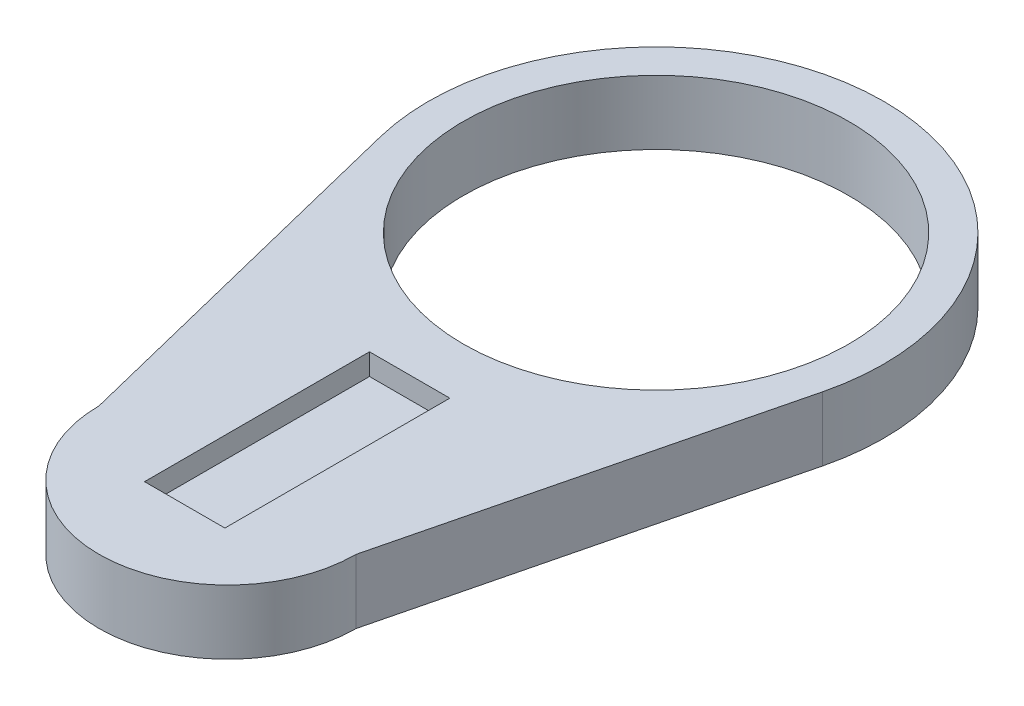
ISO-10303-21;
HEADER;
FILE_DESCRIPTION(('STEP AP214'),'2;1');
FILE_NAME('part.step','',(''),(''),'','','');
FILE_SCHEMA(('AUTOMOTIVE_DESIGN { 1 0 10303 214 1 1 1 1 }'));
ENDSEC;
DATA;
#1=APPLICATION_CONTEXT('core data for automotive mechanical design processes');
#2=APPLICATION_PROTOCOL_DEFINITION('international standard','automotive_design',2000,#1);
#3=PRODUCT_CONTEXT('',#1,'mechanical');
#4=PRODUCT('Part','Part','',(#3));
#5=PRODUCT_RELATED_PRODUCT_CATEGORY('part','',(#4));
#6=PRODUCT_DEFINITION_FORMATION('','',#4);
#7=PRODUCT_DEFINITION_CONTEXT('part definition',#1,'design');
#8=PRODUCT_DEFINITION('design','',#6,#7);
#9=PRODUCT_DEFINITION_SHAPE('','',#8);
#10=(LENGTH_UNIT() NAMED_UNIT(*) SI_UNIT(.MILLI.,.METRE.));
#11=(NAMED_UNIT(*) PLANE_ANGLE_UNIT() SI_UNIT($,.RADIAN.));
#12=(NAMED_UNIT(*) SI_UNIT($,.STERADIAN.) SOLID_ANGLE_UNIT());
#13=UNCERTAINTY_MEASURE_WITH_UNIT(LENGTH_MEASURE(1.E-05),#10,'distance_accuracy_value','');
#14=(GEOMETRIC_REPRESENTATION_CONTEXT(3) GLOBAL_UNCERTAINTY_ASSIGNED_CONTEXT((#13)) GLOBAL_UNIT_ASSIGNED_CONTEXT((#10,
#11,#12)) REPRESENTATION_CONTEXT('',''));
#15=CARTESIAN_POINT('',(0.,0.,0.));
#16=DIRECTION('',(0.,0.,1.));
#17=DIRECTION('',(1.,0.,0.));
#18=AXIS2_PLACEMENT_3D('',#15,#16,#17);
#19=CARTESIAN_POINT('',(0.,6.,-40.));
#20=DIRECTION('',(0.,1.,0.));
#21=DIRECTION('',(0.,0.,1.));
#22=AXIS2_PLACEMENT_3D('',#19,#20,#21);
#23=PLANE('',#22);
#24=DIRECTION('',(0.,0.,1.));
#25=VECTOR('',#24,1.);
#26=CARTESIAN_POINT('',(-3.75,6.,-17.));
#27=LINE('',#26,#25);
#28=CARTESIAN_POINT('',(-3.75,6.,-17.));
#29=VERTEX_POINT('',#28);
#30=CARTESIAN_POINT('',(-3.75,6.,4.));
#31=VERTEX_POINT('',#30);
#32=EDGE_CURVE('E57',#29,#31,#27,.T.);
#33=ORIENTED_EDGE('',*,*,#32,.F.);
#34=DIRECTION('',(-1.,0.,0.));
#35=VECTOR('',#34,1.);
#36=CARTESIAN_POINT('',(-3.75,6.,-17.));
#37=LINE('',#36,#35);
#38=CARTESIAN_POINT('',(3.75,6.,-17.));
#39=VERTEX_POINT('',#38);
#40=EDGE_CURVE('E139',#39,#29,#37,.T.);
#41=ORIENTED_EDGE('',*,*,#40,.F.);
#42=DIRECTION('',(0.,0.,-1.));
#43=VECTOR('',#42,1.);
#44=CARTESIAN_POINT('',(3.75,6.,-17.));
#45=LINE('',#44,#43);
#46=CARTESIAN_POINT('',(3.75,6.,4.));
#47=VERTEX_POINT('',#46);
#48=EDGE_CURVE('E143',#47,#39,#45,.T.);
#49=ORIENTED_EDGE('',*,*,#48,.F.);
#50=DIRECTION('',(1.,0.,0.));
#51=VECTOR('',#50,1.);
#52=CARTESIAN_POINT('',(-3.75,6.,4.));
#53=LINE('',#52,#51);
#54=EDGE_CURVE('E152',#31,#47,#53,.T.);
#55=ORIENTED_EDGE('',*,*,#54,.F.);
#56=EDGE_LOOP('',(#33,#41,#49,#55));
#57=FACE_BOUND('',#56,.T.);
#58=CARTESIAN_POINT('',(0.,6.,-40.));
#59=DIRECTION('',(0.,1.,0.));
#60=DIRECTION('',(0.,0.,1.));
#61=AXIS2_PLACEMENT_3D('',#58,#59,#60);
#62=CIRCLE('',#61,21.25);
#63=CARTESIAN_POINT('',(20.628820966928,6.,-34.8995837900784));
#64=VERTEX_POINT('',#63);
#65=CARTESIAN_POINT('',(-20.628820966928,6.,-34.8995837900784));
#66=VERTEX_POINT('',#65);
#67=EDGE_CURVE('E175',#64,#66,#62,.T.);
#68=ORIENTED_EDGE('',*,*,#67,.T.);
#69=DIRECTION('',(0.240019586349251,0.,0.970768045502495));
#70=VECTOR('',#69,1.);
#71=CARTESIAN_POINT('',(-20.628820966928,6.,-34.8995837900784));
#72=LINE('',#71,#70);
#73=CARTESIAN_POINT('',(-12.,6.,0.));
#74=VERTEX_POINT('',#73);
#75=EDGE_CURVE('E94',#66,#74,#72,.T.);
#76=ORIENTED_EDGE('',*,*,#75,.T.);
#77=CARTESIAN_POINT('',(0.,6.,0.));
#78=DIRECTION('',(0.,1.,0.));
#79=DIRECTION('',(0.,0.,1.));
#80=AXIS2_PLACEMENT_3D('',#77,#78,#79);
#81=CIRCLE('',#80,12.);
#82=CARTESIAN_POINT('',(12.,6.,0.));
#83=VERTEX_POINT('',#82);
#84=EDGE_CURVE('E180',#74,#83,#81,.T.);
#85=ORIENTED_EDGE('',*,*,#84,.T.);
#86=DIRECTION('',(0.240019586349251,0.,-0.970768045502495));
#87=VECTOR('',#86,1.);
#88=CARTESIAN_POINT('',(20.628820966928,6.,-34.8995837900784));
#89=LINE('',#88,#87);
#90=EDGE_CURVE('E66',#83,#64,#89,.T.);
#91=ORIENTED_EDGE('',*,*,#90,.T.);
#92=EDGE_LOOP('',(#68,#76,#85,#91));
#93=FACE_BOUND('',#92,.T.);
#94=CARTESIAN_POINT('',(0.,6.,-40.));
#95=DIRECTION('',(0.,1.,0.));
#96=DIRECTION('',(0.,0.,1.));
#97=AXIS2_PLACEMENT_3D('',#94,#95,#96);
#98=CIRCLE('',#97,18.);
#99=CARTESIAN_POINT('',(0.,6.,-22.));
#100=VERTEX_POINT('',#99);
#101=EDGE_CURVE('E167',#100,#100,#98,.T.);
#102=ORIENTED_EDGE('',*,*,#101,.F.);
#103=EDGE_LOOP('',(#102));
#104=FACE_BOUND('',#103,.T.);
#105=ADVANCED_FACE('F41',(#57,#93,#104),#23,.T.);
#106=CARTESIAN_POINT('',(0.,0.,-40.));
#107=DIRECTION('',(0.,1.,0.));
#108=DIRECTION('',(0.,0.,1.));
#109=AXIS2_PLACEMENT_3D('',#106,#107,#108);
#110=PLANE('',#109);
#111=CARTESIAN_POINT('',(0.,0.,-40.));
#112=DIRECTION('',(0.,1.,0.));
#113=DIRECTION('',(0.,0.,1.));
#114=AXIS2_PLACEMENT_3D('',#111,#112,#113);
#115=CIRCLE('',#114,21.25);
#116=CARTESIAN_POINT('',(20.628820966928,0.,-34.8995837900784));
#117=VERTEX_POINT('',#116);
#118=CARTESIAN_POINT('',(-20.628820966928,0.,-34.8995837900784));
#119=VERTEX_POINT('',#118);
#120=EDGE_CURVE('E171',#117,#119,#115,.T.);
#121=ORIENTED_EDGE('',*,*,#120,.F.);
#122=DIRECTION('',(0.240019586349251,0.,-0.970768045502495));
#123=VECTOR('',#122,1.);
#124=CARTESIAN_POINT('',(20.628820966928,0.,-34.8995837900784));
#125=LINE('',#124,#123);
#126=CARTESIAN_POINT('',(12.,0.,0.));
#127=VERTEX_POINT('',#126);
#128=EDGE_CURVE('E87',#127,#117,#125,.T.);
#129=ORIENTED_EDGE('',*,*,#128,.F.);
#130=CARTESIAN_POINT('',(0.,0.,0.));
#131=DIRECTION('',(0.,1.,0.));
#132=DIRECTION('',(0.,0.,1.));
#133=AXIS2_PLACEMENT_3D('',#130,#131,#132);
#134=CIRCLE('',#133,12.);
#135=CARTESIAN_POINT('',(-12.,0.,0.));
#136=VERTEX_POINT('',#135);
#137=EDGE_CURVE('E192',#136,#127,#134,.T.);
#138=ORIENTED_EDGE('',*,*,#137,.F.);
#139=DIRECTION('',(0.240019586349251,0.,0.970768045502495));
#140=VECTOR('',#139,1.);
#141=CARTESIAN_POINT('',(-20.628820966928,0.,-34.8995837900784));
#142=LINE('',#141,#140);
#143=EDGE_CURVE('E189',#119,#136,#142,.T.);
#144=ORIENTED_EDGE('',*,*,#143,.F.);
#145=EDGE_LOOP('',(#121,#129,#138,#144));
#146=FACE_BOUND('',#145,.T.);
#147=CARTESIAN_POINT('',(0.,0.,-40.));
#148=DIRECTION('',(0.,1.,0.));
#149=DIRECTION('',(0.,0.,1.));
#150=AXIS2_PLACEMENT_3D('',#147,#148,#149);
#151=CIRCLE('',#150,18.);
#152=CARTESIAN_POINT('',(0.,0.,-22.));
#153=VERTEX_POINT('',#152);
#154=EDGE_CURVE('E161',#153,#153,#151,.T.);
#155=ORIENTED_EDGE('',*,*,#154,.T.);
#156=EDGE_LOOP('',(#155));
#157=FACE_BOUND('',#156,.T.);
#158=ADVANCED_FACE('F210',(#146,#157),#110,.F.);
#159=CARTESIAN_POINT('',(0.,6.,-40.));
#160=DIRECTION('',(0.,-1.,0.));
#161=DIRECTION('',(0.,0.,-1.));
#162=AXIS2_PLACEMENT_3D('',#159,#160,#161);
#163=CYLINDRICAL_SURFACE('',#162,21.25);
#164=ORIENTED_EDGE('',*,*,#120,.T.);
#165=DIRECTION('',(0.,-1.,0.));
#166=VECTOR('',#165,1.);
#167=CARTESIAN_POINT('',(-20.628820966928,6.,-34.8995837900784));
#168=LINE('',#167,#166);
#169=EDGE_CURVE('E11',#66,#119,#168,.T.);
#170=ORIENTED_EDGE('',*,*,#169,.F.);
#171=ORIENTED_EDGE('',*,*,#67,.F.);
#172=DIRECTION('',(0.,-1.,0.));
#173=VECTOR('',#172,1.);
#174=CARTESIAN_POINT('',(20.628820966928,6.,-34.8995837900784));
#175=LINE('',#174,#173);
#176=EDGE_CURVE('E185',#64,#117,#175,.T.);
#177=ORIENTED_EDGE('',*,*,#176,.T.);
#178=EDGE_LOOP('',(#164,#170,#171,#177));
#179=FACE_BOUND('',#178,.T.);
#180=ADVANCED_FACE('F43',(#179),#163,.T.);
#181=CARTESIAN_POINT('',(-20.628820966928,6.,-34.8995837900784));
#182=DIRECTION('',(0.970768045502495,0.,-0.240019586349251));
#183=DIRECTION('',(-0.240019586349251,0.,-0.970768045502495));
#184=AXIS2_PLACEMENT_3D('',#181,#182,#183);
#185=PLANE('',#184);
#186=ORIENTED_EDGE('',*,*,#143,.T.);
#187=DIRECTION('',(0.,-1.,0.));
#188=VECTOR('',#187,1.);
#189=CARTESIAN_POINT('',(-12.,6.,0.));
#190=LINE('',#189,#188);
#191=EDGE_CURVE('E50',#74,#136,#190,.T.);
#192=ORIENTED_EDGE('',*,*,#191,.F.);
#193=ORIENTED_EDGE('',*,*,#75,.F.);
#194=ORIENTED_EDGE('',*,*,#169,.T.);
#195=EDGE_LOOP('',(#186,#192,#193,#194));
#196=FACE_BOUND('',#195,.T.);
#197=ADVANCED_FACE('F225',(#196),#185,.F.);
#198=CARTESIAN_POINT('',(0.,6.,0.));
#199=DIRECTION('',(0.,-1.,0.));
#200=DIRECTION('',(0.,0.,-1.));
#201=AXIS2_PLACEMENT_3D('',#198,#199,#200);
#202=CYLINDRICAL_SURFACE('',#201,12.);
#203=ORIENTED_EDGE('',*,*,#137,.T.);
#204=DIRECTION('',(0.,-1.,0.));
#205=VECTOR('',#204,1.);
#206=CARTESIAN_POINT('',(12.,6.,0.));
#207=LINE('',#206,#205);
#208=EDGE_CURVE('E199',#83,#127,#207,.T.);
#209=ORIENTED_EDGE('',*,*,#208,.F.);
#210=ORIENTED_EDGE('',*,*,#84,.F.);
#211=ORIENTED_EDGE('',*,*,#191,.T.);
#212=EDGE_LOOP('',(#203,#209,#210,#211));
#213=FACE_BOUND('',#212,.T.);
#214=ADVANCED_FACE('F206',(#213),#202,.T.);
#215=CARTESIAN_POINT('',(20.628820966928,6.,-34.8995837900784));
#216=DIRECTION('',(-0.970768045502495,0.,-0.240019586349251));
#217=DIRECTION('',(-0.240019586349251,0.,0.970768045502495));
#218=AXIS2_PLACEMENT_3D('',#215,#216,#217);
#219=PLANE('',#218);
#220=ORIENTED_EDGE('',*,*,#128,.T.);
#221=ORIENTED_EDGE('',*,*,#176,.F.);
#222=ORIENTED_EDGE('',*,*,#90,.F.);
#223=ORIENTED_EDGE('',*,*,#208,.T.);
#224=EDGE_LOOP('',(#220,#221,#222,#223));
#225=FACE_BOUND('',#224,.T.);
#226=ADVANCED_FACE('F215',(#225),#219,.F.);
#227=CARTESIAN_POINT('',(0.,6.,-40.));
#228=DIRECTION('',(0.,-1.,0.));
#229=DIRECTION('',(0.,0.,-1.));
#230=AXIS2_PLACEMENT_3D('',#227,#228,#229);
#231=CYLINDRICAL_SURFACE('',#230,18.);
#232=ORIENTED_EDGE('',*,*,#101,.T.);
#233=EDGE_LOOP('',(#232));
#234=FACE_BOUND('',#233,.T.);
#235=ORIENTED_EDGE('',*,*,#154,.F.);
#236=EDGE_LOOP('',(#235));
#237=FACE_BOUND('',#236,.T.);
#238=ADVANCED_FACE('F217',(#234,#237),#231,.F.);
#239=CARTESIAN_POINT('',(-3.75,4.,-17.));
#240=DIRECTION('',(-1.,0.,0.));
#241=DIRECTION('',(0.,0.,1.));
#242=AXIS2_PLACEMENT_3D('',#239,#240,#241);
#243=PLANE('',#242);
#244=ORIENTED_EDGE('',*,*,#32,.T.);
#245=DIRECTION('',(0.,1.,0.));
#246=VECTOR('',#245,1.);
#247=CARTESIAN_POINT('',(-3.75,4.,4.));
#248=LINE('',#247,#246);
#249=CARTESIAN_POINT('',(-3.75,4.,4.));
#250=VERTEX_POINT('',#249);
#251=EDGE_CURVE('E114',#250,#31,#248,.T.);
#252=ORIENTED_EDGE('',*,*,#251,.F.);
#253=DIRECTION('',(0.,0.,1.));
#254=VECTOR('',#253,1.);
#255=CARTESIAN_POINT('',(-3.75,4.,-17.));
#256=LINE('',#255,#254);
#257=CARTESIAN_POINT('',(-3.75,4.,-17.));
#258=VERTEX_POINT('',#257);
#259=EDGE_CURVE('E118',#258,#250,#256,.T.);
#260=ORIENTED_EDGE('',*,*,#259,.F.);
#261=DIRECTION('',(0.,1.,0.));
#262=VECTOR('',#261,1.);
#263=CARTESIAN_POINT('',(-3.75,4.,-17.));
#264=LINE('',#263,#262);
#265=EDGE_CURVE('E158',#258,#29,#264,.T.);
#266=ORIENTED_EDGE('',*,*,#265,.T.);
#267=EDGE_LOOP('',(#244,#252,#260,#266));
#268=FACE_BOUND('',#267,.T.);
#269=ADVANCED_FACE('F116',(#268),#243,.F.);
#270=CARTESIAN_POINT('',(-3.75,4.,-17.));
#271=DIRECTION('',(0.,0.,-1.));
#272=DIRECTION('',(-1.,0.,0.));
#273=AXIS2_PLACEMENT_3D('',#270,#271,#272);
#274=PLANE('',#273);
#275=ORIENTED_EDGE('',*,*,#40,.T.);
#276=ORIENTED_EDGE('',*,*,#265,.F.);
#277=DIRECTION('',(-1.,0.,0.));
#278=VECTOR('',#277,1.);
#279=CARTESIAN_POINT('',(-3.75,4.,-17.));
#280=LINE('',#279,#278);
#281=CARTESIAN_POINT('',(3.75,4.,-17.));
#282=VERTEX_POINT('',#281);
#283=EDGE_CURVE('E125',#282,#258,#280,.T.);
#284=ORIENTED_EDGE('',*,*,#283,.F.);
#285=DIRECTION('',(0.,1.,0.));
#286=VECTOR('',#285,1.);
#287=CARTESIAN_POINT('',(3.75,4.,-17.));
#288=LINE('',#287,#286);
#289=EDGE_CURVE('E162',#282,#39,#288,.T.);
#290=ORIENTED_EDGE('',*,*,#289,.T.);
#291=EDGE_LOOP('',(#275,#276,#284,#290));
#292=FACE_BOUND('',#291,.T.);
#293=ADVANCED_FACE('F237',(#292),#274,.F.);
#294=CARTESIAN_POINT('',(3.75,4.,-17.));
#295=DIRECTION('',(1.,0.,0.));
#296=DIRECTION('',(0.,0.,-1.));
#297=AXIS2_PLACEMENT_3D('',#294,#295,#296);
#298=PLANE('',#297);
#299=ORIENTED_EDGE('',*,*,#48,.T.);
#300=ORIENTED_EDGE('',*,*,#289,.F.);
#301=DIRECTION('',(0.,0.,-1.));
#302=VECTOR('',#301,1.);
#303=CARTESIAN_POINT('',(3.75,4.,-17.));
#304=LINE('',#303,#302);
#305=CARTESIAN_POINT('',(3.75,4.,4.));
#306=VERTEX_POINT('',#305);
#307=EDGE_CURVE('E134',#306,#282,#304,.T.);
#308=ORIENTED_EDGE('',*,*,#307,.F.);
#309=DIRECTION('',(0.,1.,0.));
#310=VECTOR('',#309,1.);
#311=CARTESIAN_POINT('',(3.75,4.,4.));
#312=LINE('',#311,#310);
#313=EDGE_CURVE('E124',#306,#47,#312,.T.);
#314=ORIENTED_EDGE('',*,*,#313,.T.);
#315=EDGE_LOOP('',(#299,#300,#308,#314));
#316=FACE_BOUND('',#315,.T.);
#317=ADVANCED_FACE('F240',(#316),#298,.F.);
#318=CARTESIAN_POINT('',(-3.75,4.,4.));
#319=DIRECTION('',(0.,0.,1.));
#320=DIRECTION('',(1.,0.,0.));
#321=AXIS2_PLACEMENT_3D('',#318,#319,#320);
#322=PLANE('',#321);
#323=ORIENTED_EDGE('',*,*,#54,.T.);
#324=ORIENTED_EDGE('',*,*,#313,.F.);
#325=DIRECTION('',(1.,0.,0.));
#326=VECTOR('',#325,1.);
#327=CARTESIAN_POINT('',(-3.75,4.,4.));
#328=LINE('',#327,#326);
#329=EDGE_CURVE('E128',#250,#306,#328,.T.);
#330=ORIENTED_EDGE('',*,*,#329,.F.);
#331=ORIENTED_EDGE('',*,*,#251,.T.);
#332=EDGE_LOOP('',(#323,#324,#330,#331));
#333=FACE_BOUND('',#332,.T.);
#334=ADVANCED_FACE('F129',(#333),#322,.F.);
#335=CARTESIAN_POINT('',(0.,4.,0.));
#336=DIRECTION('',(0.,1.,0.));
#337=DIRECTION('',(0.,0.,1.));
#338=AXIS2_PLACEMENT_3D('',#335,#336,#337);
#339=PLANE('',#338);
#340=ORIENTED_EDGE('',*,*,#259,.T.);
#341=ORIENTED_EDGE('',*,*,#329,.T.);
#342=ORIENTED_EDGE('',*,*,#307,.T.);
#343=ORIENTED_EDGE('',*,*,#283,.T.);
#344=EDGE_LOOP('',(#340,#341,#342,#343));
#345=FACE_BOUND('',#344,.T.);
#346=ADVANCED_FACE('F136',(#345),#339,.T.);
#347=CLOSED_SHELL('',(#105,#158,#180,#197,#214,#226,#238,#269,#293,#317,#334,#346));
#348=MANIFOLD_SOLID_BREP('B2',#347);
#349=ADVANCED_BREP_SHAPE_REPRESENTATION('',(#18,#348),#14);
#350=SHAPE_DEFINITION_REPRESENTATION(#9,#349);
ENDSEC;
END-ISO-10303-21;
